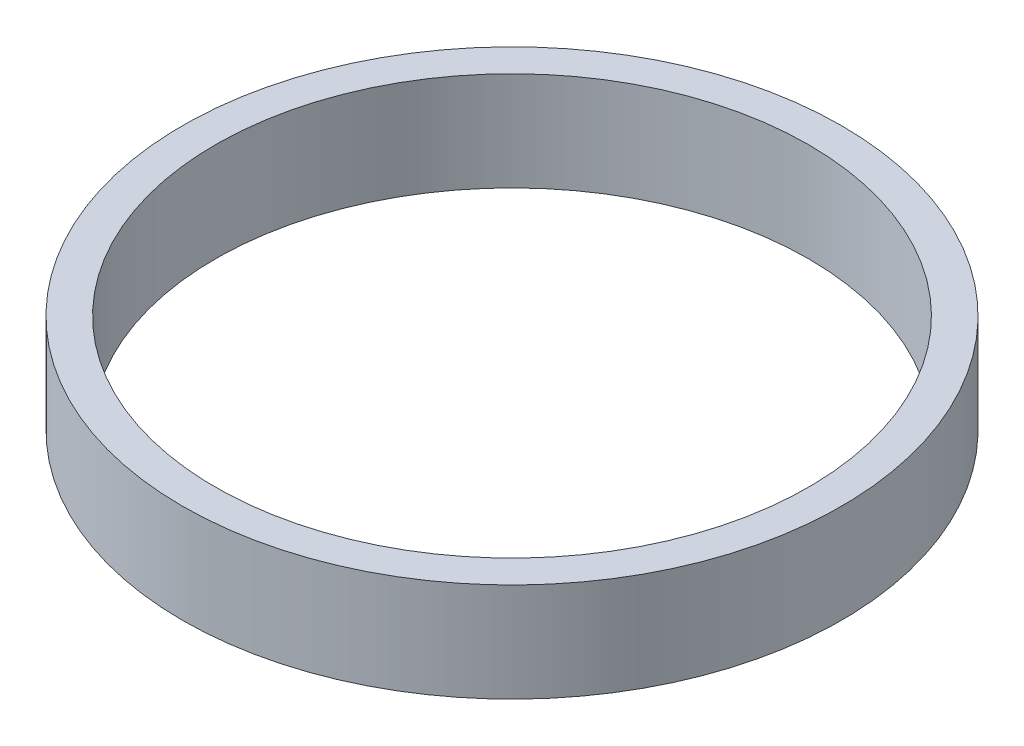
ISO-10303-21;
HEADER;
FILE_DESCRIPTION(('STEP AP214'),'2;1');
FILE_NAME('part.step','',(''),(''),'','','');
FILE_SCHEMA(('AUTOMOTIVE_DESIGN { 1 0 10303 214 1 1 1 1 }'));
ENDSEC;
DATA;
#1=APPLICATION_CONTEXT('core data for automotive mechanical design processes');
#2=APPLICATION_PROTOCOL_DEFINITION('international standard','automotive_design',2000,#1);
#3=PRODUCT_CONTEXT('',#1,'mechanical');
#4=PRODUCT('Part','Part','',(#3));
#5=PRODUCT_RELATED_PRODUCT_CATEGORY('part','',(#4));
#6=PRODUCT_DEFINITION_FORMATION('','',#4);
#7=PRODUCT_DEFINITION_CONTEXT('part definition',#1,'design');
#8=PRODUCT_DEFINITION('design','',#6,#7);
#9=PRODUCT_DEFINITION_SHAPE('','',#8);
#10=(LENGTH_UNIT() NAMED_UNIT(*) SI_UNIT(.MILLI.,.METRE.));
#11=(NAMED_UNIT(*) PLANE_ANGLE_UNIT() SI_UNIT($,.RADIAN.));
#12=(NAMED_UNIT(*) SI_UNIT($,.STERADIAN.) SOLID_ANGLE_UNIT());
#13=UNCERTAINTY_MEASURE_WITH_UNIT(LENGTH_MEASURE(1.E-05),#10,'distance_accuracy_value','');
#14=(GEOMETRIC_REPRESENTATION_CONTEXT(3) GLOBAL_UNCERTAINTY_ASSIGNED_CONTEXT((#13)) GLOBAL_UNIT_ASSIGNED_CONTEXT((#10,
#11,#12)) REPRESENTATION_CONTEXT('',''));
#15=CARTESIAN_POINT('',(0.,0.,0.));
#16=DIRECTION('',(0.,0.,1.));
#17=DIRECTION('',(1.,0.,0.));
#18=AXIS2_PLACEMENT_3D('',#15,#16,#17);
#19=CARTESIAN_POINT('',(0.,-45.6545173385847,0.));
#20=DIRECTION('',(0.,-1.,0.));
#21=DIRECTION('',(0.,0.,-1.));
#22=AXIS2_PLACEMENT_3D('',#19,#20,#21);
#23=CYLINDRICAL_SURFACE('',#22,100.);
#24=CARTESIAN_POINT('',(0.,-15.,0.));
#25=DIRECTION('',(0.,-1.,0.));
#26=DIRECTION('',(0.,0.,-1.));
#27=AXIS2_PLACEMENT_3D('',#24,#25,#26);
#28=CIRCLE('',#27,100.);
#29=CARTESIAN_POINT('',(0.,-15.,-100.));
#30=VERTEX_POINT('',#29);
#31=EDGE_CURVE('E56',#30,#30,#28,.T.);
#32=ORIENTED_EDGE('',*,*,#31,.F.);
#33=EDGE_LOOP('',(#32));
#34=FACE_BOUND('',#33,.T.);
#35=CARTESIAN_POINT('',(0.,15.,0.));
#36=DIRECTION('',(0.,-1.,0.));
#37=DIRECTION('',(0.,0.,-1.));
#38=AXIS2_PLACEMENT_3D('',#35,#36,#37);
#39=CIRCLE('',#38,100.);
#40=CARTESIAN_POINT('',(0.,15.,-100.));
#41=VERTEX_POINT('',#40);
#42=EDGE_CURVE('E10',#41,#41,#39,.T.);
#43=ORIENTED_EDGE('',*,*,#42,.T.);
#44=EDGE_LOOP('',(#43));
#45=FACE_BOUND('',#44,.T.);
#46=ADVANCED_FACE('F39',(#34,#45),#23,.T.);
#47=CARTESIAN_POINT('',(0.,15.,0.));
#48=DIRECTION('',(0.,-1.,0.));
#49=DIRECTION('',(0.,0.,-1.));
#50=AXIS2_PLACEMENT_3D('',#47,#48,#49);
#51=PLANE('',#50);
#52=ORIENTED_EDGE('',*,*,#42,.F.);
#53=EDGE_LOOP('',(#52));
#54=FACE_BOUND('',#53,.T.);
#55=CARTESIAN_POINT('',(0.,15.,0.));
#56=DIRECTION('',(0.,-1.,0.));
#57=DIRECTION('',(0.,0.,-1.));
#58=AXIS2_PLACEMENT_3D('',#55,#56,#57);
#59=CIRCLE('',#58,90.);
#60=CARTESIAN_POINT('',(0.,15.,-90.));
#61=VERTEX_POINT('',#60);
#62=EDGE_CURVE('E46',#61,#61,#59,.T.);
#63=ORIENTED_EDGE('',*,*,#62,.T.);
#64=EDGE_LOOP('',(#63));
#65=FACE_BOUND('',#64,.T.);
#66=ADVANCED_FACE('F66',(#54,#65),#51,.F.);
#67=CARTESIAN_POINT('',(0.,-45.6545173385847,0.));
#68=DIRECTION('',(0.,-1.,0.));
#69=DIRECTION('',(0.,0.,-1.));
#70=AXIS2_PLACEMENT_3D('',#67,#68,#69);
#71=CYLINDRICAL_SURFACE('',#70,90.);
#72=ORIENTED_EDGE('',*,*,#62,.F.);
#73=EDGE_LOOP('',(#72));
#74=FACE_BOUND('',#73,.T.);
#75=CARTESIAN_POINT('',(0.,-15.,0.));
#76=DIRECTION('',(0.,-1.,0.));
#77=DIRECTION('',(0.,0.,-1.));
#78=AXIS2_PLACEMENT_3D('',#75,#76,#77);
#79=CIRCLE('',#78,90.);
#80=CARTESIAN_POINT('',(0.,-15.,-90.));
#81=VERTEX_POINT('',#80);
#82=EDGE_CURVE('E51',#81,#81,#79,.T.);
#83=ORIENTED_EDGE('',*,*,#82,.T.);
#84=EDGE_LOOP('',(#83));
#85=FACE_BOUND('',#84,.T.);
#86=ADVANCED_FACE('F70',(#74,#85),#71,.F.);
#87=CARTESIAN_POINT('',(0.,-15.,0.));
#88=DIRECTION('',(0.,1.,0.));
#89=DIRECTION('',(0.,0.,1.));
#90=AXIS2_PLACEMENT_3D('',#87,#88,#89);
#91=PLANE('',#90);
#92=ORIENTED_EDGE('',*,*,#82,.F.);
#93=EDGE_LOOP('',(#92));
#94=FACE_BOUND('',#93,.T.);
#95=ORIENTED_EDGE('',*,*,#31,.T.);
#96=EDGE_LOOP('',(#95));
#97=FACE_BOUND('',#96,.T.);
#98=ADVANCED_FACE('F63',(#94,#97),#91,.F.);
#99=CLOSED_SHELL('',(#46,#66,#86,#98));
#100=MANIFOLD_SOLID_BREP('B2',#99);
#101=ADVANCED_BREP_SHAPE_REPRESENTATION('',(#18,#100),#14);
#102=SHAPE_DEFINITION_REPRESENTATION(#9,#101);
ENDSEC;
END-ISO-10303-21;
